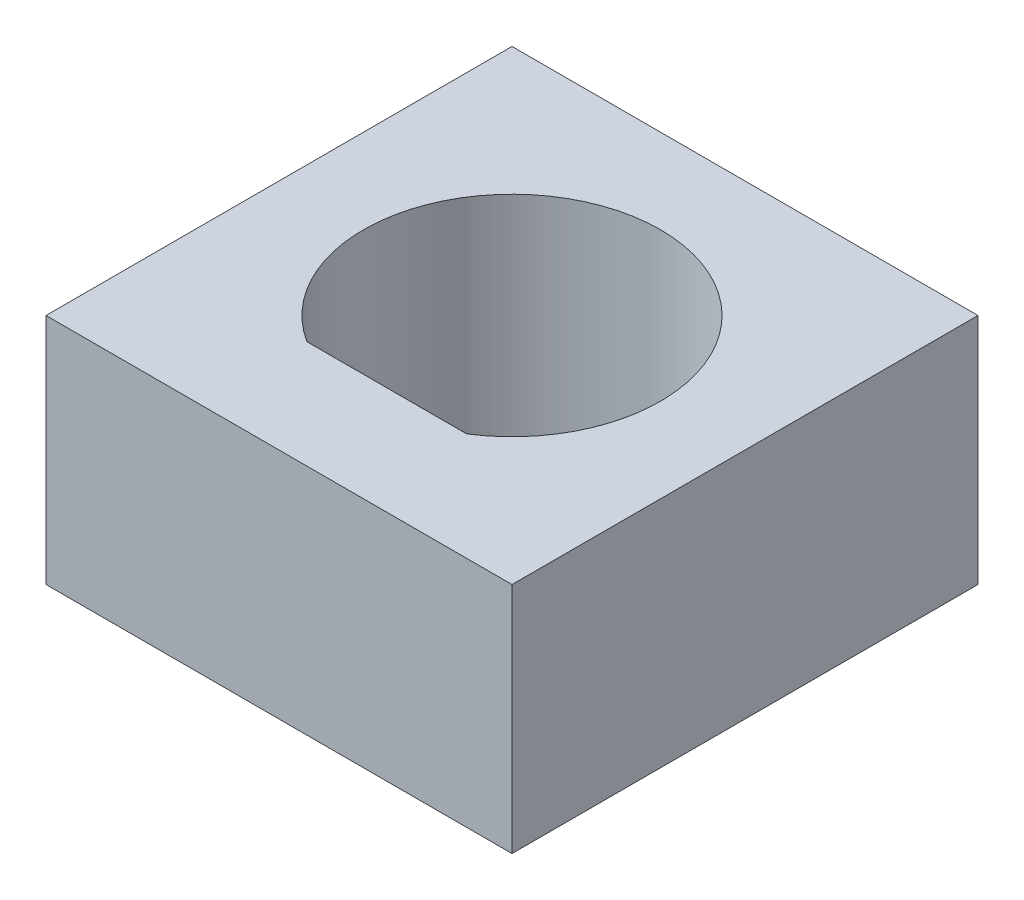
ISO-10303-21;
HEADER;
FILE_DESCRIPTION(('STEP AP214'),'2;1');
FILE_NAME('part.step','',(''),(''),'','','');
FILE_SCHEMA(('AUTOMOTIVE_DESIGN { 1 0 10303 214 1 1 1 1 }'));
ENDSEC;
DATA;
#1=APPLICATION_CONTEXT('core data for automotive mechanical design processes');
#2=APPLICATION_PROTOCOL_DEFINITION('international standard','automotive_design',2000,#1);
#3=PRODUCT_CONTEXT('',#1,'mechanical');
#4=PRODUCT('Part','Part','',(#3));
#5=PRODUCT_RELATED_PRODUCT_CATEGORY('part','',(#4));
#6=PRODUCT_DEFINITION_FORMATION('','',#4);
#7=PRODUCT_DEFINITION_CONTEXT('part definition',#1,'design');
#8=PRODUCT_DEFINITION('design','',#6,#7);
#9=PRODUCT_DEFINITION_SHAPE('','',#8);
#10=(LENGTH_UNIT() NAMED_UNIT(*) SI_UNIT(.MILLI.,.METRE.));
#11=(NAMED_UNIT(*) PLANE_ANGLE_UNIT() SI_UNIT($,.RADIAN.));
#12=(NAMED_UNIT(*) SI_UNIT($,.STERADIAN.) SOLID_ANGLE_UNIT());
#13=UNCERTAINTY_MEASURE_WITH_UNIT(LENGTH_MEASURE(1.E-05),#10,'distance_accuracy_value','');
#14=(GEOMETRIC_REPRESENTATION_CONTEXT(3) GLOBAL_UNCERTAINTY_ASSIGNED_CONTEXT((#13)) GLOBAL_UNIT_ASSIGNED_CONTEXT((#10,
#11,#12)) REPRESENTATION_CONTEXT('',''));
#15=CARTESIAN_POINT('',(0.,0.,0.));
#16=DIRECTION('',(0.,0.,1.));
#17=DIRECTION('',(1.,0.,0.));
#18=AXIS2_PLACEMENT_3D('',#15,#16,#17);
#19=CARTESIAN_POINT('',(0.,5.08,0.));
#20=DIRECTION('',(0.,1.,0.));
#21=DIRECTION('',(0.,0.,1.));
#22=AXIS2_PLACEMENT_3D('',#19,#20,#21);
#23=PLANE('',#22);
#24=DIRECTION('',(0.,0.,1.));
#25=VECTOR('',#24,1.);
#26=CARTESIAN_POINT('',(-5.08,5.08,5.08));
#27=LINE('',#26,#25);
#28=CARTESIAN_POINT('',(-5.08,5.08,-5.08));
#29=VERTEX_POINT('',#28);
#30=CARTESIAN_POINT('',(-5.08,5.08,5.08));
#31=VERTEX_POINT('',#30);
#32=EDGE_CURVE('E102',#29,#31,#27,.T.);
#33=ORIENTED_EDGE('',*,*,#32,.T.);
#34=DIRECTION('',(1.,0.,0.));
#35=VECTOR('',#34,1.);
#36=CARTESIAN_POINT('',(5.08,5.08,5.08));
#37=LINE('',#36,#35);
#38=CARTESIAN_POINT('',(5.08,5.08,5.08));
#39=VERTEX_POINT('',#38);
#40=EDGE_CURVE('E105',#31,#39,#37,.T.);
#41=ORIENTED_EDGE('',*,*,#40,.T.);
#42=DIRECTION('',(0.,0.,-1.));
#43=VECTOR('',#42,1.);
#44=CARTESIAN_POINT('',(5.08,5.08,5.08));
#45=LINE('',#44,#43);
#46=CARTESIAN_POINT('',(5.08,5.08,-5.08));
#47=VERTEX_POINT('',#46);
#48=EDGE_CURVE('E108',#39,#47,#45,.T.);
#49=ORIENTED_EDGE('',*,*,#48,.T.);
#50=DIRECTION('',(-1.,0.,0.));
#51=VECTOR('',#50,1.);
#52=CARTESIAN_POINT('',(5.08,5.08,-5.08));
#53=LINE('',#52,#51);
#54=EDGE_CURVE('E110',#47,#29,#53,.T.);
#55=ORIENTED_EDGE('',*,*,#54,.T.);
#56=EDGE_LOOP('',(#33,#41,#49,#55));
#57=FACE_BOUND('',#56,.T.);
#58=DIRECTION('',(1.,0.,0.));
#59=VECTOR('',#58,1.);
#60=CARTESIAN_POINT('',(1.74133626850186,5.08,2.7305));
#61=LINE('',#60,#59);
#62=CARTESIAN_POINT('',(-1.74133626850186,5.08,2.7305));
#63=VERTEX_POINT('',#62);
#64=CARTESIAN_POINT('',(1.74133626850186,5.08,2.7305));
#65=VERTEX_POINT('',#64);
#66=EDGE_CURVE('E85',#63,#65,#61,.T.);
#67=ORIENTED_EDGE('',*,*,#66,.F.);
#68=CARTESIAN_POINT('',(0.,5.08,0.));
#69=DIRECTION('',(0.,1.,0.));
#70=DIRECTION('',(0.,0.,1.));
#71=AXIS2_PLACEMENT_3D('',#68,#69,#70);
#72=CIRCLE('',#71,3.2385);
#73=EDGE_CURVE('E91',#65,#63,#72,.T.);
#74=ORIENTED_EDGE('',*,*,#73,.F.);
#75=EDGE_LOOP('',(#67,#74));
#76=FACE_BOUND('',#75,.T.);
#77=ADVANCED_FACE('F33',(#57,#76),#23,.T.);
#78=CARTESIAN_POINT('',(0.,0.,0.));
#79=DIRECTION('',(0.,1.,0.));
#80=DIRECTION('',(0.,0.,1.));
#81=AXIS2_PLACEMENT_3D('',#78,#79,#80);
#82=PLANE('',#81);
#83=DIRECTION('',(0.,0.,1.));
#84=VECTOR('',#83,1.);
#85=CARTESIAN_POINT('',(-5.08,0.,5.08));
#86=LINE('',#85,#84);
#87=CARTESIAN_POINT('',(-5.08,0.,-5.08));
#88=VERTEX_POINT('',#87);
#89=CARTESIAN_POINT('',(-5.08,0.,5.08));
#90=VERTEX_POINT('',#89);
#91=EDGE_CURVE('E101',#88,#90,#86,.T.);
#92=ORIENTED_EDGE('',*,*,#91,.F.);
#93=DIRECTION('',(-1.,0.,0.));
#94=VECTOR('',#93,1.);
#95=CARTESIAN_POINT('',(5.08,0.,-5.08));
#96=LINE('',#95,#94);
#97=CARTESIAN_POINT('',(5.08,0.,-5.08));
#98=VERTEX_POINT('',#97);
#99=EDGE_CURVE('E106',#98,#88,#96,.T.);
#100=ORIENTED_EDGE('',*,*,#99,.F.);
#101=DIRECTION('',(0.,0.,-1.));
#102=VECTOR('',#101,1.);
#103=CARTESIAN_POINT('',(5.08,0.,5.08));
#104=LINE('',#103,#102);
#105=CARTESIAN_POINT('',(5.08,0.,5.08));
#106=VERTEX_POINT('',#105);
#107=EDGE_CURVE('E117',#106,#98,#104,.T.);
#108=ORIENTED_EDGE('',*,*,#107,.F.);
#109=DIRECTION('',(1.,0.,0.));
#110=VECTOR('',#109,1.);
#111=CARTESIAN_POINT('',(5.08,0.,5.08));
#112=LINE('',#111,#110);
#113=EDGE_CURVE('E115',#90,#106,#112,.T.);
#114=ORIENTED_EDGE('',*,*,#113,.F.);
#115=EDGE_LOOP('',(#92,#100,#108,#114));
#116=FACE_BOUND('',#115,.T.);
#117=CARTESIAN_POINT('',(0.,0.,0.));
#118=DIRECTION('',(0.,1.,0.));
#119=DIRECTION('',(0.,0.,1.));
#120=AXIS2_PLACEMENT_3D('',#117,#118,#119);
#121=CIRCLE('',#120,3.2385);
#122=CARTESIAN_POINT('',(1.74133626850186,0.,2.7305));
#123=VERTEX_POINT('',#122);
#124=CARTESIAN_POINT('',(-1.74133626850186,0.,2.7305));
#125=VERTEX_POINT('',#124);
#126=EDGE_CURVE('E55',#123,#125,#121,.T.);
#127=ORIENTED_EDGE('',*,*,#126,.T.);
#128=DIRECTION('',(1.,0.,0.));
#129=VECTOR('',#128,1.);
#130=CARTESIAN_POINT('',(1.74133626850186,0.,2.7305));
#131=LINE('',#130,#129);
#132=EDGE_CURVE('E95',#125,#123,#131,.T.);
#133=ORIENTED_EDGE('',*,*,#132,.T.);
#134=EDGE_LOOP('',(#127,#133));
#135=FACE_BOUND('',#134,.T.);
#136=ADVANCED_FACE('F135',(#116,#135),#82,.F.);
#137=CARTESIAN_POINT('',(-5.08,5.08,5.08));
#138=DIRECTION('',(1.,0.,0.));
#139=DIRECTION('',(0.,0.,-1.));
#140=AXIS2_PLACEMENT_3D('',#137,#138,#139);
#141=PLANE('',#140);
#142=ORIENTED_EDGE('',*,*,#91,.T.);
#143=DIRECTION('',(0.,-1.,0.));
#144=VECTOR('',#143,1.);
#145=CARTESIAN_POINT('',(-5.08,5.08,5.08));
#146=LINE('',#145,#144);
#147=EDGE_CURVE('E11',#31,#90,#146,.T.);
#148=ORIENTED_EDGE('',*,*,#147,.F.);
#149=ORIENTED_EDGE('',*,*,#32,.F.);
#150=DIRECTION('',(0.,-1.,0.));
#151=VECTOR('',#150,1.);
#152=CARTESIAN_POINT('',(-5.08,5.08,-5.08));
#153=LINE('',#152,#151);
#154=EDGE_CURVE('E112',#29,#88,#153,.T.);
#155=ORIENTED_EDGE('',*,*,#154,.T.);
#156=EDGE_LOOP('',(#142,#148,#149,#155));
#157=FACE_BOUND('',#156,.T.);
#158=ADVANCED_FACE('F35',(#157),#141,.F.);
#159=CARTESIAN_POINT('',(5.08,5.08,5.08));
#160=DIRECTION('',(0.,0.,-1.));
#161=DIRECTION('',(-1.,0.,0.));
#162=AXIS2_PLACEMENT_3D('',#159,#160,#161);
#163=PLANE('',#162);
#164=ORIENTED_EDGE('',*,*,#113,.T.);
#165=DIRECTION('',(0.,-1.,0.));
#166=VECTOR('',#165,1.);
#167=CARTESIAN_POINT('',(5.08,5.08,5.08));
#168=LINE('',#167,#166);
#169=EDGE_CURVE('E41',#39,#106,#168,.T.);
#170=ORIENTED_EDGE('',*,*,#169,.F.);
#171=ORIENTED_EDGE('',*,*,#40,.F.);
#172=ORIENTED_EDGE('',*,*,#147,.T.);
#173=EDGE_LOOP('',(#164,#170,#171,#172));
#174=FACE_BOUND('',#173,.T.);
#175=ADVANCED_FACE('F145',(#174),#163,.F.);
#176=CARTESIAN_POINT('',(5.08,5.08,5.08));
#177=DIRECTION('',(-1.,0.,0.));
#178=DIRECTION('',(0.,0.,1.));
#179=AXIS2_PLACEMENT_3D('',#176,#177,#178);
#180=PLANE('',#179);
#181=ORIENTED_EDGE('',*,*,#107,.T.);
#182=DIRECTION('',(0.,-1.,0.));
#183=VECTOR('',#182,1.);
#184=CARTESIAN_POINT('',(5.08,5.08,-5.08));
#185=LINE('',#184,#183);
#186=EDGE_CURVE('E122',#47,#98,#185,.T.);
#187=ORIENTED_EDGE('',*,*,#186,.F.);
#188=ORIENTED_EDGE('',*,*,#48,.F.);
#189=ORIENTED_EDGE('',*,*,#169,.T.);
#190=EDGE_LOOP('',(#181,#187,#188,#189));
#191=FACE_BOUND('',#190,.T.);
#192=ADVANCED_FACE('F129',(#191),#180,.F.);
#193=CARTESIAN_POINT('',(5.08,5.08,-5.08));
#194=DIRECTION('',(0.,0.,1.));
#195=DIRECTION('',(1.,0.,0.));
#196=AXIS2_PLACEMENT_3D('',#193,#194,#195);
#197=PLANE('',#196);
#198=ORIENTED_EDGE('',*,*,#99,.T.);
#199=ORIENTED_EDGE('',*,*,#154,.F.);
#200=ORIENTED_EDGE('',*,*,#54,.F.);
#201=ORIENTED_EDGE('',*,*,#186,.T.);
#202=EDGE_LOOP('',(#198,#199,#200,#201));
#203=FACE_BOUND('',#202,.T.);
#204=ADVANCED_FACE('F139',(#203),#197,.F.);
#205=CARTESIAN_POINT('',(0.,5.08,0.));
#206=DIRECTION('',(0.,-1.,0.));
#207=DIRECTION('',(0.,0.,-1.));
#208=AXIS2_PLACEMENT_3D('',#205,#206,#207);
#209=CYLINDRICAL_SURFACE('',#208,3.2385);
#210=ORIENTED_EDGE('',*,*,#126,.F.);
#211=DIRECTION('',(0.,-1.,0.));
#212=VECTOR('',#211,1.);
#213=CARTESIAN_POINT('',(1.74133626850186,5.08,2.7305));
#214=LINE('',#213,#212);
#215=EDGE_CURVE('E87',#65,#123,#214,.T.);
#216=ORIENTED_EDGE('',*,*,#215,.F.);
#217=ORIENTED_EDGE('',*,*,#73,.T.);
#218=DIRECTION('',(0.,-1.,0.));
#219=VECTOR('',#218,1.);
#220=CARTESIAN_POINT('',(-1.74133626850186,5.08,2.7305));
#221=LINE('',#220,#219);
#222=EDGE_CURVE('E48',#63,#125,#221,.T.);
#223=ORIENTED_EDGE('',*,*,#222,.T.);
#224=EDGE_LOOP('',(#210,#216,#217,#223));
#225=FACE_BOUND('',#224,.T.);
#226=ADVANCED_FACE('F93',(#225),#209,.F.);
#227=CARTESIAN_POINT('',(1.74133626850186,5.08,2.7305));
#228=DIRECTION('',(0.,0.,-1.));
#229=DIRECTION('',(-1.,0.,0.));
#230=AXIS2_PLACEMENT_3D('',#227,#228,#229);
#231=PLANE('',#230);
#232=ORIENTED_EDGE('',*,*,#132,.F.);
#233=ORIENTED_EDGE('',*,*,#222,.F.);
#234=ORIENTED_EDGE('',*,*,#66,.T.);
#235=ORIENTED_EDGE('',*,*,#215,.T.);
#236=EDGE_LOOP('',(#232,#233,#234,#235));
#237=FACE_BOUND('',#236,.T.);
#238=ADVANCED_FACE('F86',(#237),#231,.T.);
#239=CLOSED_SHELL('',(#77,#136,#158,#175,#192,#204,#226,#238));
#240=MANIFOLD_SOLID_BREP('B2',#239);
#241=ADVANCED_BREP_SHAPE_REPRESENTATION('',(#18,#240),#14);
#242=SHAPE_DEFINITION_REPRESENTATION(#9,#241);
ENDSEC;
END-ISO-10303-21;
